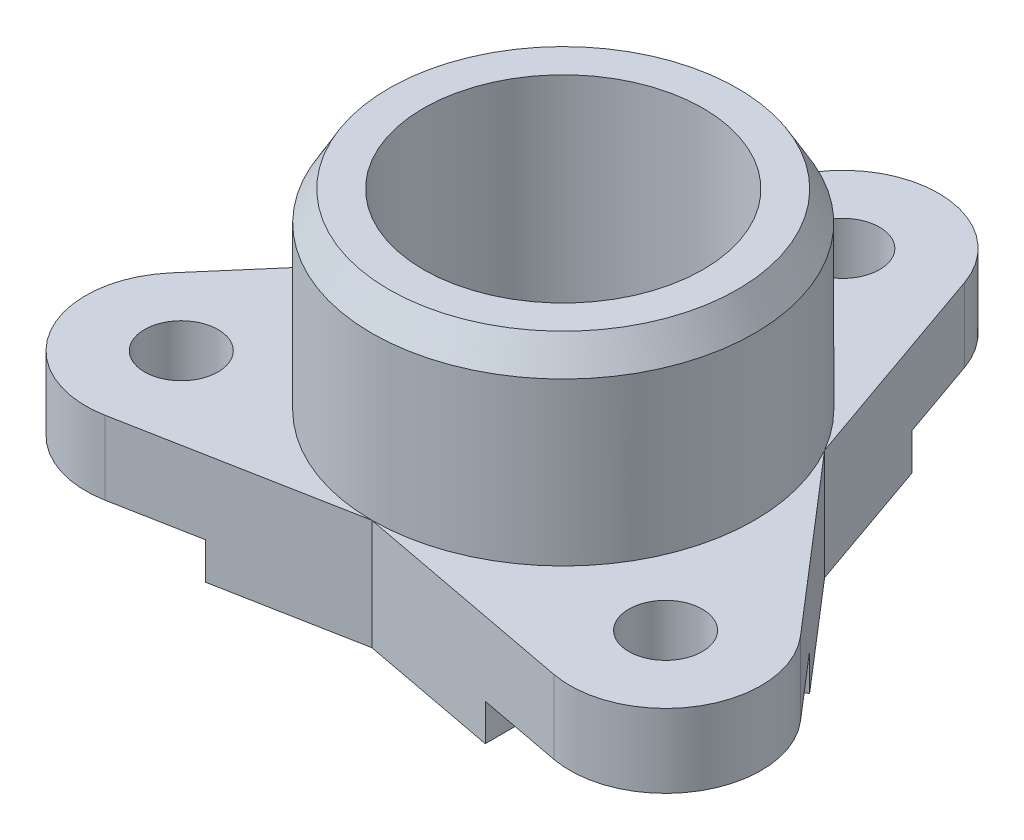
ISO-10303-21;
HEADER;
FILE_DESCRIPTION(('STEP AP214'),'2;1');
FILE_NAME('part.step','',(''),(''),'','','');
FILE_SCHEMA(('AUTOMOTIVE_DESIGN { 1 0 10303 214 1 1 1 1 }'));
ENDSEC;
DATA;
#1=APPLICATION_CONTEXT('core data for automotive mechanical design processes');
#2=APPLICATION_PROTOCOL_DEFINITION('international standard','automotive_design',2000,#1);
#3=PRODUCT_CONTEXT('',#1,'mechanical');
#4=PRODUCT('Part','Part','',(#3));
#5=PRODUCT_RELATED_PRODUCT_CATEGORY('part','',(#4));
#6=PRODUCT_DEFINITION_FORMATION('','',#4);
#7=PRODUCT_DEFINITION_CONTEXT('part definition',#1,'design');
#8=PRODUCT_DEFINITION('design','',#6,#7);
#9=PRODUCT_DEFINITION_SHAPE('','',#8);
#10=(LENGTH_UNIT() NAMED_UNIT(*) SI_UNIT(.MILLI.,.METRE.));
#11=(NAMED_UNIT(*) PLANE_ANGLE_UNIT() SI_UNIT($,.RADIAN.));
#12=(NAMED_UNIT(*) SI_UNIT($,.STERADIAN.) SOLID_ANGLE_UNIT());
#13=UNCERTAINTY_MEASURE_WITH_UNIT(LENGTH_MEASURE(1.E-05),#10,'distance_accuracy_value','');
#14=(GEOMETRIC_REPRESENTATION_CONTEXT(3) GLOBAL_UNCERTAINTY_ASSIGNED_CONTEXT((#13)) GLOBAL_UNIT_ASSIGNED_CONTEXT((#10,
#11,#12)) REPRESENTATION_CONTEXT('',''));
#15=CARTESIAN_POINT('',(0.,0.,0.));
#16=DIRECTION('',(0.,0.,1.));
#17=DIRECTION('',(1.,0.,0.));
#18=AXIS2_PLACEMENT_3D('',#15,#16,#17);
#19=CARTESIAN_POINT('',(0.,0.,0.));
#20=DIRECTION('',(0.,1.,0.));
#21=DIRECTION('',(0.,0.,1.));
#22=AXIS2_PLACEMENT_3D('',#19,#20,#21);
#23=PLANE('',#22);
#24=CARTESIAN_POINT('',(-8.22724133595217,0.,4.75));
#25=DIRECTION('',(0.,1.,0.));
#26=DIRECTION('',(0.,0.,1.));
#27=AXIS2_PLACEMENT_3D('',#24,#25,#26);
#28=CIRCLE('',#27,1.25);
#29=CARTESIAN_POINT('',(-8.22724133595217,0.,6.));
#30=VERTEX_POINT('',#29);
#31=EDGE_CURVE('E328',#30,#30,#28,.T.);
#32=ORIENTED_EDGE('',*,*,#31,.T.);
#33=EDGE_LOOP('',(#32));
#34=FACE_BOUND('',#33,.T.);
#35=CARTESIAN_POINT('',(0.,0.,-9.5));
#36=DIRECTION('',(0.,1.,0.));
#37=DIRECTION('',(0.,0.,1.));
#38=AXIS2_PLACEMENT_3D('',#35,#36,#37);
#39=CIRCLE('',#38,1.25);
#40=CARTESIAN_POINT('',(0.,0.,-8.25));
#41=VERTEX_POINT('',#40);
#42=EDGE_CURVE('E354',#41,#41,#39,.T.);
#43=ORIENTED_EDGE('',*,*,#42,.T.);
#44=EDGE_LOOP('',(#43));
#45=FACE_BOUND('',#44,.T.);
#46=CARTESIAN_POINT('',(0.,0.,0.));
#47=DIRECTION('',(0.,1.,0.));
#48=DIRECTION('',(0.,0.,1.));
#49=AXIS2_PLACEMENT_3D('',#46,#47,#48);
#50=CIRCLE('',#49,4.75);
#51=CARTESIAN_POINT('',(0.,0.,4.75));
#52=VERTEX_POINT('',#51);
#53=EDGE_CURVE('E299',#52,#52,#50,.T.);
#54=ORIENTED_EDGE('',*,*,#53,.T.);
#55=EDGE_LOOP('',(#54));
#56=FACE_BOUND('',#55,.T.);
#57=CARTESIAN_POINT('',(8.22724133595217,0.,4.75));
#58=DIRECTION('',(0.,1.,0.));
#59=DIRECTION('',(0.,0.,1.));
#60=AXIS2_PLACEMENT_3D('',#57,#58,#59);
#61=CIRCLE('',#60,1.25);
#62=CARTESIAN_POINT('',(8.22724133595217,0.,6.));
#63=VERTEX_POINT('',#62);
#64=EDGE_CURVE('E331',#63,#63,#61,.T.);
#65=ORIENTED_EDGE('',*,*,#64,.T.);
#66=EDGE_LOOP('',(#65));
#67=FACE_BOUND('',#66,.T.);
#68=DIRECTION('',(-0.499999999999992,0.,0.866025403784443));
#69=VECTOR('',#68,1.);
#70=CARTESIAN_POINT('',(-4.97964607176055,0.,-2.87499999999995));
#71=LINE('',#70,#69);
#72=CARTESIAN_POINT('',(-2.60464607176059,0.,-6.98862066797606));
#73=VERTEX_POINT('',#72);
#74=CARTESIAN_POINT('',(-7.35464607176051,0.,1.23862066797615));
#75=VERTEX_POINT('',#74);
#76=EDGE_CURVE('E210',#73,#75,#71,.T.);
#77=ORIENTED_EDGE('',*,*,#76,.F.);
#78=DIRECTION('',(-0.866025403784443,0.,-0.499999999999992));
#79=VECTOR('',#78,1.);
#80=CARTESIAN_POINT('',(2.37499999999996,0.,-4.1136206679761));
#81=LINE('',#80,#79);
#82=CARTESIAN_POINT('',(-4.03303634923954,0.,-7.81330217918636));
#83=VERTEX_POINT('',#82);
#84=EDGE_CURVE('E207',#73,#83,#81,.T.);
#85=ORIENTED_EDGE('',*,*,#84,.T.);
#86=DIRECTION('',(-0.330161167685148,0.,0.943924575033821));
#87=VECTOR('',#86,1.);
#88=CARTESIAN_POINT('',(-6.02840364790872,0.,-2.10858456312533));
#89=LINE('',#88,#87);
#90=CARTESIAN_POINT('',(-3.06775486885992,0.,-10.5730237949767));
#91=VERTEX_POINT('',#90);
#92=EDGE_CURVE('E345',#91,#83,#89,.T.);
#93=ORIENTED_EDGE('',*,*,#92,.F.);
#94=CARTESIAN_POINT('',(0.,0.,-9.5));
#95=DIRECTION('',(0.,1.,0.));
#96=DIRECTION('',(0.,0.,1.));
#97=AXIS2_PLACEMENT_3D('',#94,#95,#96);
#98=CIRCLE('',#97,3.25);
#99=CARTESIAN_POINT('',(3.06775486885992,0.,-10.5730237949767));
#100=VERTEX_POINT('',#99);
#101=EDGE_CURVE('E343',#100,#91,#98,.T.);
#102=ORIENTED_EDGE('',*,*,#101,.F.);
#103=DIRECTION('',(0.330161167685148,0.,0.943924575033821));
#104=VECTOR('',#103,1.);
#105=CARTESIAN_POINT('',(6.02840364790872,0.,-2.10858456312532));
#106=LINE('',#105,#104);
#107=CARTESIAN_POINT('',(4.03303634923946,0.,-7.81330217918642));
#108=VERTEX_POINT('',#107);
#109=EDGE_CURVE('E341',#100,#108,#106,.T.);
#110=ORIENTED_EDGE('',*,*,#109,.T.);
#111=DIRECTION('',(0.866025403784436,0.,-0.500000000000004));
#112=VECTOR('',#111,1.);
#113=CARTESIAN_POINT('',(-2.37500000000002,0.,-4.11362066797607));
#114=LINE('',#113,#112);
#115=CARTESIAN_POINT('',(2.60464607176049,0.,-6.9886206679761));
#116=VERTEX_POINT('',#115);
#117=EDGE_CURVE('E222',#116,#108,#114,.T.);
#118=ORIENTED_EDGE('',*,*,#117,.F.);
#119=DIRECTION('',(-0.500000000000004,0.,-0.866025403784436));
#120=VECTOR('',#119,1.);
#121=CARTESIAN_POINT('',(4.97964607176051,0.,-2.87500000000002));
#122=LINE('',#121,#120);
#123=CARTESIAN_POINT('',(7.35464607176053,0.,1.23862066797605));
#124=VERTEX_POINT('',#123);
#125=EDGE_CURVE('E60',#124,#116,#122,.T.);
#126=ORIENTED_EDGE('',*,*,#125,.F.);
#127=DIRECTION('',(0.866025403784436,0.,-0.500000000000004));
#128=VECTOR('',#127,1.);
#129=CARTESIAN_POINT('',(2.37500000000002,0.,4.11362066797607));
#130=LINE('',#129,#128);
#131=CARTESIAN_POINT('',(8.78303634923947,0.,0.413939156765781));
#132=VERTEX_POINT('',#131);
#133=EDGE_CURVE('E232',#124,#132,#130,.T.);
#134=ORIENTED_EDGE('',*,*,#133,.T.);
#135=DIRECTION('',(0.652382077393145,0.,0.757890246075383));
#136=VECTOR('',#135,1.);
#137=CARTESIAN_POINT('',(4.8402896216486,0.,-4.16645842179307));
#138=LINE('',#137,#136);
#139=CARTESIAN_POINT('',(10.6903846356972,0.,2.62975824847228));
#140=VERTEX_POINT('',#139);
#141=EDGE_CURVE('E339',#132,#140,#138,.T.);
#142=ORIENTED_EDGE('',*,*,#141,.T.);
#143=CARTESIAN_POINT('',(8.22724133595217,0.,4.75));
#144=DIRECTION('',(0.,1.,0.));
#145=DIRECTION('',(0.,0.,1.));
#146=AXIS2_PLACEMENT_3D('',#143,#144,#145);
#147=CIRCLE('',#146,3.25);
#148=CARTESIAN_POINT('',(7.62262976683724,0.,7.94326554650445));
#149=VERTEX_POINT('',#148);
#150=EDGE_CURVE('E336',#149,#140,#147,.T.);
#151=ORIENTED_EDGE('',*,*,#150,.F.);
#152=DIRECTION('',(0.982543245078293,0.,0.186034328958438));
#153=VECTOR('',#152,1.);
#154=CARTESIAN_POINT('',(-1.18811402626011,0.,6.27504298491839));
#155=LINE('',#154,#153);
#156=CARTESIAN_POINT('',(4.75,0.,7.39936302242063));
#157=VERTEX_POINT('',#156);
#158=EDGE_CURVE('E334',#157,#149,#155,.T.);
#159=ORIENTED_EDGE('',*,*,#158,.F.);
#160=DIRECTION('',(0.,0.,1.));
#161=VECTOR('',#160,1.);
#162=CARTESIAN_POINT('',(4.75,0.,0.));
#163=LINE('',#162,#161);
#164=CARTESIAN_POINT('',(4.75,0.,5.75));
#165=VERTEX_POINT('',#164);
#166=EDGE_CURVE('E250',#165,#157,#163,.T.);
#167=ORIENTED_EDGE('',*,*,#166,.F.);
#168=DIRECTION('',(1.,0.,0.));
#169=VECTOR('',#168,1.);
#170=CARTESIAN_POINT('',(0.,0.,5.75));
#171=LINE('',#170,#169);
#172=CARTESIAN_POINT('',(-4.75,0.,5.75));
#173=VERTEX_POINT('',#172);
#174=EDGE_CURVE('E275',#173,#165,#171,.T.);
#175=ORIENTED_EDGE('',*,*,#174,.F.);
#176=DIRECTION('',(0.,0.,1.));
#177=VECTOR('',#176,1.);
#178=CARTESIAN_POINT('',(-4.75,0.,0.));
#179=LINE('',#178,#177);
#180=CARTESIAN_POINT('',(-4.75,0.,7.39936302242063));
#181=VERTEX_POINT('',#180);
#182=EDGE_CURVE('E262',#173,#181,#179,.T.);
#183=ORIENTED_EDGE('',*,*,#182,.T.);
#184=DIRECTION('',(0.982543245078294,0.,-0.186034328958438));
#185=VECTOR('',#184,1.);
#186=CARTESIAN_POINT('',(1.18811402626011,0.,6.2750429849184));
#187=LINE('',#186,#185);
#188=CARTESIAN_POINT('',(-7.62262976683724,0.,7.94326554650445));
#189=VERTEX_POINT('',#188);
#190=EDGE_CURVE('E351',#189,#181,#187,.T.);
#191=ORIENTED_EDGE('',*,*,#190,.F.);
#192=CARTESIAN_POINT('',(-8.22724133595217,0.,4.75));
#193=DIRECTION('',(0.,1.,0.));
#194=DIRECTION('',(0.,0.,1.));
#195=AXIS2_PLACEMENT_3D('',#192,#193,#194);
#196=CIRCLE('',#195,3.25);
#197=CARTESIAN_POINT('',(-10.6903846356972,0.,2.62975824847228));
#198=VERTEX_POINT('',#197);
#199=EDGE_CURVE('E349',#198,#189,#196,.T.);
#200=ORIENTED_EDGE('',*,*,#199,.F.);
#201=DIRECTION('',(-0.652382077393145,0.,0.757890246075383));
#202=VECTOR('',#201,1.);
#203=CARTESIAN_POINT('',(-4.8402896216486,0.,-4.16645842179307));
#204=LINE('',#203,#202);
#205=CARTESIAN_POINT('',(-8.78303634923946,0.,0.413939156765772));
#206=VERTEX_POINT('',#205);
#207=EDGE_CURVE('E347',#206,#198,#204,.T.);
#208=ORIENTED_EDGE('',*,*,#207,.F.);
#209=DIRECTION('',(-0.866025403784443,0.,-0.499999999999992));
#210=VECTOR('',#209,1.);
#211=CARTESIAN_POINT('',(-2.37499999999996,0.,4.1136206679761));
#212=LINE('',#211,#210);
#213=EDGE_CURVE('E52',#75,#206,#212,.T.);
#214=ORIENTED_EDGE('',*,*,#213,.F.);
#215=EDGE_LOOP('',(#77,#85,#93,#102,#110,#118,#126,#134,#142,#151,#159,#167,#175,#183,#191,#200,
#208,#214));
#216=FACE_BOUND('',#215,.T.);
#217=ADVANCED_FACE('F36',(#34,#45,#56,#67,#216),#23,.F.);
#218=CARTESIAN_POINT('',(0.,2.5,0.));
#219=DIRECTION('',(0.,1.,0.));
#220=DIRECTION('',(0.,0.,1.));
#221=AXIS2_PLACEMENT_3D('',#218,#219,#220);
#222=PLANE('',#221);
#223=CARTESIAN_POINT('',(-8.22724133595217,2.5,4.75));
#224=DIRECTION('',(0.,1.,0.));
#225=DIRECTION('',(0.,0.,1.));
#226=AXIS2_PLACEMENT_3D('',#223,#224,#225);
#227=CIRCLE('',#226,1.25);
#228=CARTESIAN_POINT('',(-8.22724133595217,2.5,6.));
#229=VERTEX_POINT('',#228);
#230=EDGE_CURVE('E295',#229,#229,#227,.T.);
#231=ORIENTED_EDGE('',*,*,#230,.F.);
#232=EDGE_LOOP('',(#231));
#233=FACE_BOUND('',#232,.T.);
#234=DIRECTION('',(0.982543245078294,0.,-0.186034328958438));
#235=VECTOR('',#234,1.);
#236=CARTESIAN_POINT('',(1.18811402626011,2.5,6.2750429849184));
#237=LINE('',#236,#235);
#238=CARTESIAN_POINT('',(-7.62262976683724,2.5,7.94326554650445));
#239=VERTEX_POINT('',#238);
#240=CARTESIAN_POINT('',(0.,2.5,6.5));
#241=VERTEX_POINT('',#240);
#242=EDGE_CURVE('E321',#239,#241,#237,.T.);
#243=ORIENTED_EDGE('',*,*,#242,.T.);
#244=CARTESIAN_POINT('',(0.,2.5,0.));
#245=DIRECTION('',(0.,1.,0.));
#246=DIRECTION('',(0.,0.,1.));
#247=AXIS2_PLACEMENT_3D('',#244,#245,#246);
#248=CIRCLE('',#247,6.5);
#249=CARTESIAN_POINT('',(-5.62916512459885,2.5,-3.25000000000001));
#250=VERTEX_POINT('',#249);
#251=EDGE_CURVE('E294',#241,#250,#248,.F.);
#252=ORIENTED_EDGE('',*,*,#251,.T.);
#253=DIRECTION('',(-0.652382077393145,0.,0.757890246075383));
#254=VECTOR('',#253,1.);
#255=CARTESIAN_POINT('',(-4.8402896216486,2.5,-4.16645842179307));
#256=LINE('',#255,#254);
#257=CARTESIAN_POINT('',(-10.6903846356972,2.5,2.62975824847228));
#258=VERTEX_POINT('',#257);
#259=EDGE_CURVE('E188',#250,#258,#256,.T.);
#260=ORIENTED_EDGE('',*,*,#259,.T.);
#261=CARTESIAN_POINT('',(-8.22724133595217,2.5,4.75));
#262=DIRECTION('',(0.,1.,0.));
#263=DIRECTION('',(0.,0.,1.));
#264=AXIS2_PLACEMENT_3D('',#261,#262,#263);
#265=CIRCLE('',#264,3.25);
#266=EDGE_CURVE('E319',#258,#239,#265,.T.);
#267=ORIENTED_EDGE('',*,*,#266,.T.);
#268=EDGE_LOOP('',(#243,#252,#260,#267));
#269=FACE_BOUND('',#268,.T.);
#270=ADVANCED_FACE('F396',(#233,#269),#222,.T.);
#271=CARTESIAN_POINT('',(0.,2.5,-9.5));
#272=DIRECTION('',(0.,1.,0.));
#273=DIRECTION('',(0.,0.,1.));
#274=AXIS2_PLACEMENT_3D('',#271,#272,#273);
#275=CIRCLE('',#274,1.25);
#276=CARTESIAN_POINT('',(0.,2.5,-8.25));
#277=VERTEX_POINT('',#276);
#278=EDGE_CURVE('E324',#277,#277,#275,.T.);
#279=ORIENTED_EDGE('',*,*,#278,.F.);
#280=EDGE_LOOP('',(#279));
#281=FACE_BOUND('',#280,.T.);
#282=DIRECTION('',(-0.330161167685148,0.,0.943924575033821));
#283=VECTOR('',#282,1.);
#284=CARTESIAN_POINT('',(-6.02840364790872,2.5,-2.10858456312533));
#285=LINE('',#284,#283);
#286=CARTESIAN_POINT('',(-3.06775486885992,2.5,-10.5730237949767));
#287=VERTEX_POINT('',#286);
#288=EDGE_CURVE('E315',#287,#250,#285,.T.);
#289=ORIENTED_EDGE('',*,*,#288,.T.);
#290=CARTESIAN_POINT('',(5.62916512459885,2.5,-3.25000000000001));
#291=VERTEX_POINT('',#290);
#292=EDGE_CURVE('E293',#250,#291,#248,.F.);
#293=ORIENTED_EDGE('',*,*,#292,.T.);
#294=DIRECTION('',(0.330161167685148,0.,0.943924575033821));
#295=VECTOR('',#294,1.);
#296=CARTESIAN_POINT('',(6.02840364790872,2.5,-2.10858456312532));
#297=LINE('',#296,#295);
#298=CARTESIAN_POINT('',(3.06775486885992,2.5,-10.5730237949767));
#299=VERTEX_POINT('',#298);
#300=EDGE_CURVE('E310',#299,#291,#297,.T.);
#301=ORIENTED_EDGE('',*,*,#300,.F.);
#302=CARTESIAN_POINT('',(0.,2.5,-9.5));
#303=DIRECTION('',(0.,1.,0.));
#304=DIRECTION('',(0.,0.,1.));
#305=AXIS2_PLACEMENT_3D('',#302,#303,#304);
#306=CIRCLE('',#305,3.25);
#307=EDGE_CURVE('E313',#299,#287,#306,.T.);
#308=ORIENTED_EDGE('',*,*,#307,.T.);
#309=EDGE_LOOP('',(#289,#293,#301,#308));
#310=FACE_BOUND('',#309,.T.);
#311=ADVANCED_FACE('F402',(#281,#310),#222,.T.);
#312=CARTESIAN_POINT('',(-1.18811402626011,2.5,6.27504298491839));
#313=DIRECTION('',(0.186034328958438,0.,-0.982543245078294));
#314=DIRECTION('',(-0.982543245078294,0.,-0.186034328958438));
#315=AXIS2_PLACEMENT_3D('',#312,#313,#314);
#316=PLANE('',#315);
#317=DIRECTION('',(0.,-1.,0.));
#318=VECTOR('',#317,1.);
#319=CARTESIAN_POINT('',(0.,2.5,6.5));
#320=LINE('',#319,#318);
#321=CARTESIAN_POINT('',(0.,-1.25,6.5));
#322=VERTEX_POINT('',#321);
#323=EDGE_CURVE('E327',#241,#322,#320,.T.);
#324=ORIENTED_EDGE('',*,*,#323,.T.);
#325=DIRECTION('',(0.982543245078293,0.,0.186034328958438));
#326=VECTOR('',#325,1.);
#327=CARTESIAN_POINT('',(-1.18811402626011,-1.25,6.27504298491839));
#328=LINE('',#327,#326);
#329=CARTESIAN_POINT('',(4.75,-1.25,7.39936302242063));
#330=VERTEX_POINT('',#329);
#331=EDGE_CURVE('E261',#322,#330,#328,.T.);
#332=ORIENTED_EDGE('',*,*,#331,.T.);
#333=DIRECTION('',(0.,1.,0.));
#334=VECTOR('',#333,1.);
#335=CARTESIAN_POINT('',(4.75,-1.25,7.39936302242063));
#336=LINE('',#335,#334);
#337=EDGE_CURVE('E272',#330,#157,#336,.T.);
#338=ORIENTED_EDGE('',*,*,#337,.T.);
#339=ORIENTED_EDGE('',*,*,#158,.T.);
#340=DIRECTION('',(0.,-1.,0.));
#341=VECTOR('',#340,1.);
#342=CARTESIAN_POINT('',(7.62262976683724,2.5,7.94326554650445));
#343=LINE('',#342,#341);
#344=CARTESIAN_POINT('',(7.62262976683724,2.5,7.94326554650445));
#345=VERTEX_POINT('',#344);
#346=EDGE_CURVE('E374',#345,#149,#343,.T.);
#347=ORIENTED_EDGE('',*,*,#346,.F.);
#348=DIRECTION('',(0.982543245078293,0.,0.186034328958438));
#349=VECTOR('',#348,1.);
#350=CARTESIAN_POINT('',(-1.18811402626011,2.5,6.27504298491839));
#351=LINE('',#350,#349);
#352=EDGE_CURVE('E302',#241,#345,#351,.T.);
#353=ORIENTED_EDGE('',*,*,#352,.F.);
#354=EDGE_LOOP('',(#324,#332,#338,#339,#347,#353));
#355=FACE_BOUND('',#354,.T.);
#356=ADVANCED_FACE('F446',(#355),#316,.F.);
#357=CARTESIAN_POINT('',(8.22724133595217,2.5,4.75));
#358=DIRECTION('',(0.,-1.,0.));
#359=DIRECTION('',(0.,0.,-1.));
#360=AXIS2_PLACEMENT_3D('',#357,#358,#359);
#361=CYLINDRICAL_SURFACE('',#360,3.25);
#362=ORIENTED_EDGE('',*,*,#150,.T.);
#363=DIRECTION('',(0.,-1.,0.));
#364=VECTOR('',#363,1.);
#365=CARTESIAN_POINT('',(10.6903846356972,2.5,2.62975824847228));
#366=LINE('',#365,#364);
#367=CARTESIAN_POINT('',(10.6903846356972,2.5,2.62975824847228));
#368=VERTEX_POINT('',#367);
#369=EDGE_CURVE('E371',#368,#140,#366,.T.);
#370=ORIENTED_EDGE('',*,*,#369,.F.);
#371=CARTESIAN_POINT('',(8.22724133595217,2.5,4.75));
#372=DIRECTION('',(0.,1.,0.));
#373=DIRECTION('',(0.,0.,1.));
#374=AXIS2_PLACEMENT_3D('',#371,#372,#373);
#375=CIRCLE('',#374,3.25);
#376=EDGE_CURVE('E305',#345,#368,#375,.T.);
#377=ORIENTED_EDGE('',*,*,#376,.F.);
#378=ORIENTED_EDGE('',*,*,#346,.T.);
#379=EDGE_LOOP('',(#362,#370,#377,#378));
#380=FACE_BOUND('',#379,.T.);
#381=ADVANCED_FACE('F442',(#380),#361,.T.);
#382=CARTESIAN_POINT('',(4.8402896216486,2.5,-4.16645842179307));
#383=DIRECTION('',(0.757890246075383,0.,-0.652382077393145));
#384=DIRECTION('',(-0.652382077393145,0.,-0.757890246075383));
#385=AXIS2_PLACEMENT_3D('',#382,#383,#384);
#386=PLANE('',#385);
#387=ORIENTED_EDGE('',*,*,#141,.F.);
#388=DIRECTION('',(0.,1.,0.));
#389=VECTOR('',#388,1.);
#390=CARTESIAN_POINT('',(8.78303634923947,-1.25,0.413939156765729));
#391=LINE('',#390,#389);
#392=CARTESIAN_POINT('',(8.78303634923947,-1.25,0.413939156765729));
#393=VERTEX_POINT('',#392);
#394=EDGE_CURVE('E247',#393,#132,#391,.T.);
#395=ORIENTED_EDGE('',*,*,#394,.F.);
#396=DIRECTION('',(-0.652382077393149,0.,-0.75789024607538));
#397=VECTOR('',#396,1.);
#398=CARTESIAN_POINT('',(4.84028962164859,-1.25,-4.16645842179309));
#399=LINE('',#398,#397);
#400=CARTESIAN_POINT('',(5.62916512459884,-1.25,-3.25000000000003));
#401=VERTEX_POINT('',#400);
#402=EDGE_CURVE('E228',#393,#401,#399,.T.);
#403=ORIENTED_EDGE('',*,*,#402,.T.);
#404=DIRECTION('',(0.,-1.,0.));
#405=VECTOR('',#404,1.);
#406=CARTESIAN_POINT('',(5.62916512459885,2.5,-3.25));
#407=LINE('',#406,#405);
#408=EDGE_CURVE('E369',#291,#401,#407,.T.);
#409=ORIENTED_EDGE('',*,*,#408,.F.);
#410=DIRECTION('',(0.652382077393145,0.,0.757890246075383));
#411=VECTOR('',#410,1.);
#412=CARTESIAN_POINT('',(4.8402896216486,2.5,-4.16645842179307));
#413=LINE('',#412,#411);
#414=EDGE_CURVE('E307',#291,#368,#413,.T.);
#415=ORIENTED_EDGE('',*,*,#414,.T.);
#416=ORIENTED_EDGE('',*,*,#369,.T.);
#417=EDGE_LOOP('',(#387,#395,#403,#409,#415,#416));
#418=FACE_BOUND('',#417,.T.);
#419=ADVANCED_FACE('F438',(#418),#386,.T.);
#420=CARTESIAN_POINT('',(6.02840364790872,2.5,-2.10858456312532));
#421=DIRECTION('',(0.943924575033821,0.,-0.330161167685148));
#422=DIRECTION('',(-0.330161167685148,0.,-0.943924575033821));
#423=AXIS2_PLACEMENT_3D('',#420,#421,#422);
#424=PLANE('',#423);
#425=ORIENTED_EDGE('',*,*,#109,.F.);
#426=DIRECTION('',(0.,-1.,0.));
#427=VECTOR('',#426,1.);
#428=CARTESIAN_POINT('',(3.06775486885992,2.5,-10.5730237949767));
#429=LINE('',#428,#427);
#430=EDGE_CURVE('E367',#299,#100,#429,.T.);
#431=ORIENTED_EDGE('',*,*,#430,.F.);
#432=ORIENTED_EDGE('',*,*,#300,.T.);
#433=ORIENTED_EDGE('',*,*,#408,.T.);
#434=DIRECTION('',(-0.330161167685153,0.,-0.94392457503382));
#435=VECTOR('',#434,1.);
#436=CARTESIAN_POINT('',(6.02840364790871,-1.25,-2.10858456312535));
#437=LINE('',#436,#435);
#438=CARTESIAN_POINT('',(4.03303634923943,-1.25,-7.81330217918642));
#439=VERTEX_POINT('',#438);
#440=EDGE_CURVE('E231',#401,#439,#437,.T.);
#441=ORIENTED_EDGE('',*,*,#440,.T.);
#442=DIRECTION('',(0.,1.,0.));
#443=VECTOR('',#442,1.);
#444=CARTESIAN_POINT('',(4.03303634923943,-1.25,-7.81330217918642));
#445=LINE('',#444,#443);
#446=EDGE_CURVE('E242',#439,#108,#445,.T.);
#447=ORIENTED_EDGE('',*,*,#446,.T.);
#448=EDGE_LOOP('',(#425,#431,#432,#433,#441,#447));
#449=FACE_BOUND('',#448,.T.);
#450=ADVANCED_FACE('F434',(#449),#424,.T.);
#451=CARTESIAN_POINT('',(0.,2.5,-9.5));
#452=DIRECTION('',(0.,-1.,0.));
#453=DIRECTION('',(0.,0.,-1.));
#454=AXIS2_PLACEMENT_3D('',#451,#452,#453);
#455=CYLINDRICAL_SURFACE('',#454,3.25);
#456=ORIENTED_EDGE('',*,*,#101,.T.);
#457=DIRECTION('',(0.,-1.,0.));
#458=VECTOR('',#457,1.);
#459=CARTESIAN_POINT('',(-3.06775486885992,2.5,-10.5730237949767));
#460=LINE('',#459,#458);
#461=EDGE_CURVE('E192',#287,#91,#460,.T.);
#462=ORIENTED_EDGE('',*,*,#461,.F.);
#463=ORIENTED_EDGE('',*,*,#307,.F.);
#464=ORIENTED_EDGE('',*,*,#430,.T.);
#465=EDGE_LOOP('',(#456,#462,#463,#464));
#466=FACE_BOUND('',#465,.T.);
#467=ADVANCED_FACE('F431',(#466),#455,.T.);
#468=CARTESIAN_POINT('',(-6.02840364790872,2.5,-2.10858456312533));
#469=DIRECTION('',(0.943924575033821,0.,0.330161167685148));
#470=DIRECTION('',(0.330161167685148,0.,-0.943924575033821));
#471=AXIS2_PLACEMENT_3D('',#468,#469,#470);
#472=PLANE('',#471);
#473=ORIENTED_EDGE('',*,*,#92,.T.);
#474=DIRECTION('',(0.,1.,0.));
#475=VECTOR('',#474,1.);
#476=CARTESIAN_POINT('',(-4.03303634923954,-1.25,-7.81330217918636));
#477=LINE('',#476,#475);
#478=CARTESIAN_POINT('',(-4.03303634923954,-1.25,-7.81330217918636));
#479=VERTEX_POINT('',#478);
#480=EDGE_CURVE('E206',#479,#83,#477,.T.);
#481=ORIENTED_EDGE('',*,*,#480,.F.);
#482=DIRECTION('',(-0.33016116768514,0.,0.943924575033824));
#483=VECTOR('',#482,1.);
#484=CARTESIAN_POINT('',(-6.02840364790874,-1.25,-2.10858456312527));
#485=LINE('',#484,#483);
#486=CARTESIAN_POINT('',(-5.62916512459888,-1.25,-3.24999999999995));
#487=VERTEX_POINT('',#486);
#488=EDGE_CURVE('E199',#479,#487,#485,.T.);
#489=ORIENTED_EDGE('',*,*,#488,.T.);
#490=DIRECTION('',(0.,-1.,0.));
#491=VECTOR('',#490,1.);
#492=CARTESIAN_POINT('',(-5.62916512459885,2.5,-3.25));
#493=LINE('',#492,#491);
#494=EDGE_CURVE('E183',#250,#487,#493,.T.);
#495=ORIENTED_EDGE('',*,*,#494,.F.);
#496=ORIENTED_EDGE('',*,*,#288,.F.);
#497=ORIENTED_EDGE('',*,*,#461,.T.);
#498=EDGE_LOOP('',(#473,#481,#489,#495,#496,#497));
#499=FACE_BOUND('',#498,.T.);
#500=ADVANCED_FACE('F205',(#499),#472,.F.);
#501=CARTESIAN_POINT('',(-4.8402896216486,2.5,-4.16645842179307));
#502=DIRECTION('',(0.757890246075383,0.,0.652382077393145));
#503=DIRECTION('',(0.652382077393145,0.,-0.757890246075383));
#504=AXIS2_PLACEMENT_3D('',#501,#502,#503);
#505=PLANE('',#504);
#506=ORIENTED_EDGE('',*,*,#494,.T.);
#507=DIRECTION('',(-0.652382077393138,0.,0.757890246075389));
#508=VECTOR('',#507,1.);
#509=CARTESIAN_POINT('',(-4.84028962164864,-1.25,-4.16645842179302));
#510=LINE('',#509,#508);
#511=CARTESIAN_POINT('',(-8.78303634923946,-1.25,0.413939156765853));
#512=VERTEX_POINT('',#511);
#513=EDGE_CURVE('E186',#487,#512,#510,.T.);
#514=ORIENTED_EDGE('',*,*,#513,.T.);
#515=DIRECTION('',(0.,1.,0.));
#516=VECTOR('',#515,1.);
#517=CARTESIAN_POINT('',(-8.78303634923946,-1.25,0.413939156765853));
#518=LINE('',#517,#516);
#519=EDGE_CURVE('E218',#512,#206,#518,.T.);
#520=ORIENTED_EDGE('',*,*,#519,.T.);
#521=ORIENTED_EDGE('',*,*,#207,.T.);
#522=DIRECTION('',(0.,-1.,0.));
#523=VECTOR('',#522,1.);
#524=CARTESIAN_POINT('',(-10.6903846356972,2.5,2.62975824847228));
#525=LINE('',#524,#523);
#526=EDGE_CURVE('E193',#258,#198,#525,.T.);
#527=ORIENTED_EDGE('',*,*,#526,.F.);
#528=ORIENTED_EDGE('',*,*,#259,.F.);
#529=EDGE_LOOP('',(#506,#514,#520,#521,#527,#528));
#530=FACE_BOUND('',#529,.T.);
#531=ADVANCED_FACE('F185',(#530),#505,.F.);
#532=CARTESIAN_POINT('',(-8.22724133595217,2.5,4.75));
#533=DIRECTION('',(0.,-1.,0.));
#534=DIRECTION('',(0.,0.,-1.));
#535=AXIS2_PLACEMENT_3D('',#532,#533,#534);
#536=CYLINDRICAL_SURFACE('',#535,3.25);
#537=ORIENTED_EDGE('',*,*,#199,.T.);
#538=DIRECTION('',(0.,-1.,0.));
#539=VECTOR('',#538,1.);
#540=CARTESIAN_POINT('',(-7.62262976683724,2.5,7.94326554650445));
#541=LINE('',#540,#539);
#542=EDGE_CURVE('E360',#239,#189,#541,.T.);
#543=ORIENTED_EDGE('',*,*,#542,.F.);
#544=ORIENTED_EDGE('',*,*,#266,.F.);
#545=ORIENTED_EDGE('',*,*,#526,.T.);
#546=EDGE_LOOP('',(#537,#543,#544,#545));
#547=FACE_BOUND('',#546,.T.);
#548=ADVANCED_FACE('F418',(#547),#536,.T.);
#549=CARTESIAN_POINT('',(0.,2.5,-9.5));
#550=DIRECTION('',(0.,-1.,0.));
#551=DIRECTION('',(0.,0.,-1.));
#552=AXIS2_PLACEMENT_3D('',#549,#550,#551);
#553=CYLINDRICAL_SURFACE('',#552,1.25);
#554=ORIENTED_EDGE('',*,*,#278,.T.);
#555=EDGE_LOOP('',(#554));
#556=FACE_BOUND('',#555,.T.);
#557=ORIENTED_EDGE('',*,*,#42,.F.);
#558=EDGE_LOOP('',(#557));
#559=FACE_BOUND('',#558,.T.);
#560=ADVANCED_FACE('F414',(#556,#559),#553,.F.);
#561=CARTESIAN_POINT('',(1.18811402626011,2.5,6.2750429849184));
#562=DIRECTION('',(-0.186034328958438,0.,-0.982543245078294));
#563=DIRECTION('',(-0.982543245078294,0.,0.186034328958438));
#564=AXIS2_PLACEMENT_3D('',#561,#562,#563);
#565=PLANE('',#564);
#566=ORIENTED_EDGE('',*,*,#190,.T.);
#567=DIRECTION('',(0.,1.,0.));
#568=VECTOR('',#567,1.);
#569=CARTESIAN_POINT('',(-4.75,-1.25,7.39936302242063));
#570=LINE('',#569,#568);
#571=CARTESIAN_POINT('',(-4.75,-1.25,7.39936302242063));
#572=VERTEX_POINT('',#571);
#573=EDGE_CURVE('E279',#572,#181,#570,.T.);
#574=ORIENTED_EDGE('',*,*,#573,.F.);
#575=DIRECTION('',(0.982543245078294,0.,-0.186034328958438));
#576=VECTOR('',#575,1.);
#577=CARTESIAN_POINT('',(1.18811402626011,-1.25,6.2750429849184));
#578=LINE('',#577,#576);
#579=EDGE_CURVE('E258',#572,#322,#578,.T.);
#580=ORIENTED_EDGE('',*,*,#579,.T.);
#581=ORIENTED_EDGE('',*,*,#323,.F.);
#582=ORIENTED_EDGE('',*,*,#242,.F.);
#583=ORIENTED_EDGE('',*,*,#542,.T.);
#584=EDGE_LOOP('',(#566,#574,#580,#581,#582,#583));
#585=FACE_BOUND('',#584,.T.);
#586=ADVANCED_FACE('F417',(#585),#565,.F.);
#587=CARTESIAN_POINT('',(8.22724133595217,2.5,4.75));
#588=DIRECTION('',(0.,-1.,0.));
#589=DIRECTION('',(0.,0.,-1.));
#590=AXIS2_PLACEMENT_3D('',#587,#588,#589);
#591=CYLINDRICAL_SURFACE('',#590,1.25);
#592=CARTESIAN_POINT('',(8.22724133595217,2.5,4.75));
#593=DIRECTION('',(0.,1.,0.));
#594=DIRECTION('',(0.,0.,1.));
#595=AXIS2_PLACEMENT_3D('',#592,#593,#594);
#596=CIRCLE('',#595,1.25);
#597=CARTESIAN_POINT('',(8.22724133595217,2.5,6.));
#598=VERTEX_POINT('',#597);
#599=EDGE_CURVE('E298',#598,#598,#596,.T.);
#600=ORIENTED_EDGE('',*,*,#599,.T.);
#601=EDGE_LOOP('',(#600));
#602=FACE_BOUND('',#601,.T.);
#603=ORIENTED_EDGE('',*,*,#64,.F.);
#604=EDGE_LOOP('',(#603));
#605=FACE_BOUND('',#604,.T.);
#606=ADVANCED_FACE('F422',(#602,#605),#591,.F.);
#607=CARTESIAN_POINT('',(-8.22724133595217,2.5,4.75));
#608=DIRECTION('',(0.,-1.,0.));
#609=DIRECTION('',(0.,0.,-1.));
#610=AXIS2_PLACEMENT_3D('',#607,#608,#609);
#611=CYLINDRICAL_SURFACE('',#610,1.25);
#612=ORIENTED_EDGE('',*,*,#230,.T.);
#613=EDGE_LOOP('',(#612));
#614=FACE_BOUND('',#613,.T.);
#615=ORIENTED_EDGE('',*,*,#31,.F.);
#616=EDGE_LOOP('',(#615));
#617=FACE_BOUND('',#616,.T.);
#618=ADVANCED_FACE('F412',(#614,#617),#611,.F.);
#619=CARTESIAN_POINT('',(0.,2.5,0.));
#620=DIRECTION('',(0.,-1.,0.));
#621=DIRECTION('',(0.,0.,-1.));
#622=AXIS2_PLACEMENT_3D('',#619,#620,#621);
#623=CYLINDRICAL_SURFACE('',#622,4.75);
#624=ORIENTED_EDGE('',*,*,#53,.F.);
#625=EDGE_LOOP('',(#624));
#626=FACE_BOUND('',#625,.T.);
#627=CARTESIAN_POINT('',(0.,9.,0.));
#628=DIRECTION('',(0.,1.,0.));
#629=DIRECTION('',(0.,0.,1.));
#630=AXIS2_PLACEMENT_3D('',#627,#628,#629);
#631=CIRCLE('',#630,4.75);
#632=CARTESIAN_POINT('',(0.,9.,4.75));
#633=VERTEX_POINT('',#632);
#634=EDGE_CURVE('E281',#633,#633,#631,.T.);
#635=ORIENTED_EDGE('',*,*,#634,.T.);
#636=EDGE_LOOP('',(#635));
#637=FACE_BOUND('',#636,.T.);
#638=ADVANCED_FACE('F409',(#626,#637),#623,.F.);
#639=ORIENTED_EDGE('',*,*,#599,.F.);
#640=EDGE_LOOP('',(#639));
#641=FACE_BOUND('',#640,.T.);
#642=ORIENTED_EDGE('',*,*,#414,.F.);
#643=EDGE_CURVE('E290',#291,#241,#248,.F.);
#644=ORIENTED_EDGE('',*,*,#643,.T.);
#645=ORIENTED_EDGE('',*,*,#352,.T.);
#646=ORIENTED_EDGE('',*,*,#376,.T.);
#647=EDGE_LOOP('',(#642,#644,#645,#646));
#648=FACE_BOUND('',#647,.T.);
#649=ADVANCED_FACE('F405',(#641,#648),#222,.T.);
#650=CARTESIAN_POINT('',(0.,9.,0.));
#651=DIRECTION('',(0.,-1.,0.));
#652=DIRECTION('',(0.,0.,-1.));
#653=AXIS2_PLACEMENT_3D('',#650,#651,#652);
#654=CYLINDRICAL_SURFACE('',#653,6.5);
#655=CARTESIAN_POINT('',(0.,7.99999999999999,0.));
#656=DIRECTION('',(0.,1.,0.));
#657=DIRECTION('',(0.,0.,1.));
#658=AXIS2_PLACEMENT_3D('',#655,#656,#657);
#659=CIRCLE('',#658,6.5);
#660=CARTESIAN_POINT('',(0.,7.99999999999999,6.5));
#661=VERTEX_POINT('',#660);
#662=EDGE_CURVE('E11',#661,#661,#659,.F.);
#663=ORIENTED_EDGE('',*,*,#662,.T.);
#664=EDGE_LOOP('',(#663));
#665=FACE_BOUND('',#664,.T.);
#666=ORIENTED_EDGE('',*,*,#251,.F.);
#667=ORIENTED_EDGE('',*,*,#643,.F.);
#668=ORIENTED_EDGE('',*,*,#292,.F.);
#669=EDGE_LOOP('',(#666,#667,#668));
#670=FACE_BOUND('',#669,.T.);
#671=ADVANCED_FACE('F392',(#665,#670),#654,.T.);
#672=CARTESIAN_POINT('',(0.,9.,0.));
#673=DIRECTION('',(0.,1.,0.));
#674=DIRECTION('',(0.,0.,1.));
#675=AXIS2_PLACEMENT_3D('',#672,#673,#674);
#676=PLANE('',#675);
#677=CARTESIAN_POINT('',(0.,9.,0.));
#678=DIRECTION('',(0.,1.,0.));
#679=DIRECTION('',(0.,0.,1.));
#680=AXIS2_PLACEMENT_3D('',#677,#678,#679);
#681=CIRCLE('',#680,5.92264973081037);
#682=CARTESIAN_POINT('',(0.,9.,5.92264973081037));
#683=VERTEX_POINT('',#682);
#684=EDGE_CURVE('E45',#683,#683,#681,.T.);
#685=ORIENTED_EDGE('',*,*,#684,.T.);
#686=EDGE_LOOP('',(#685));
#687=FACE_BOUND('',#686,.T.);
#688=ORIENTED_EDGE('',*,*,#634,.F.);
#689=EDGE_LOOP('',(#688));
#690=FACE_BOUND('',#689,.T.);
#691=ADVANCED_FACE('F379',(#687,#690),#676,.T.);
#692=CARTESIAN_POINT('',(0.,9.,0.));
#693=DIRECTION('',(0.,-1.,0.));
#694=DIRECTION('',(0.,0.,-1.));
#695=AXIS2_PLACEMENT_3D('',#692,#693,#694);
#696=CONICAL_SURFACE('',#695,5.92264973081037,0.523598775598296);
#697=ORIENTED_EDGE('',*,*,#662,.F.);
#698=EDGE_LOOP('',(#697));
#699=FACE_BOUND('',#698,.T.);
#700=ORIENTED_EDGE('',*,*,#684,.F.);
#701=EDGE_LOOP('',(#700));
#702=FACE_BOUND('',#701,.T.);
#703=ADVANCED_FACE('F39',(#699,#702),#696,.T.);
#704=CARTESIAN_POINT('',(-4.75,-1.25,0.));
#705=DIRECTION('',(-1.,0.,0.));
#706=DIRECTION('',(0.,0.,1.));
#707=AXIS2_PLACEMENT_3D('',#704,#705,#706);
#708=PLANE('',#707);
#709=ORIENTED_EDGE('',*,*,#182,.F.);
#710=DIRECTION('',(0.,1.,0.));
#711=VECTOR('',#710,1.);
#712=CARTESIAN_POINT('',(-4.75,-1.25,5.75));
#713=LINE('',#712,#711);
#714=CARTESIAN_POINT('',(-4.75,-1.25,5.75));
#715=VERTEX_POINT('',#714);
#716=EDGE_CURVE('E282',#715,#173,#713,.T.);
#717=ORIENTED_EDGE('',*,*,#716,.F.);
#718=DIRECTION('',(0.,0.,1.));
#719=VECTOR('',#718,1.);
#720=CARTESIAN_POINT('',(-4.75,-1.25,0.));
#721=LINE('',#720,#719);
#722=EDGE_CURVE('E269',#715,#572,#721,.T.);
#723=ORIENTED_EDGE('',*,*,#722,.T.);
#724=ORIENTED_EDGE('',*,*,#573,.T.);
#725=EDGE_LOOP('',(#709,#717,#723,#724));
#726=FACE_BOUND('',#725,.T.);
#727=ADVANCED_FACE('F383',(#726),#708,.T.);
#728=CARTESIAN_POINT('',(0.,-1.25,5.75));
#729=DIRECTION('',(0.,0.,1.));
#730=DIRECTION('',(1.,0.,0.));
#731=AXIS2_PLACEMENT_3D('',#728,#729,#730);
#732=PLANE('',#731);
#733=ORIENTED_EDGE('',*,*,#174,.T.);
#734=DIRECTION('',(0.,1.,0.));
#735=VECTOR('',#734,1.);
#736=CARTESIAN_POINT('',(4.75,-1.25,5.75));
#737=LINE('',#736,#735);
#738=CARTESIAN_POINT('',(4.75,-1.25,5.75));
#739=VERTEX_POINT('',#738);
#740=EDGE_CURVE('E284',#739,#165,#737,.T.);
#741=ORIENTED_EDGE('',*,*,#740,.F.);
#742=DIRECTION('',(1.,0.,0.));
#743=VECTOR('',#742,1.);
#744=CARTESIAN_POINT('',(0.,-1.25,5.75));
#745=LINE('',#744,#743);
#746=EDGE_CURVE('E267',#715,#739,#745,.T.);
#747=ORIENTED_EDGE('',*,*,#746,.F.);
#748=ORIENTED_EDGE('',*,*,#716,.T.);
#749=EDGE_LOOP('',(#733,#741,#747,#748));
#750=FACE_BOUND('',#749,.T.);
#751=ADVANCED_FACE('F389',(#750),#732,.F.);
#752=CARTESIAN_POINT('',(4.75,-1.25,0.));
#753=DIRECTION('',(-1.,0.,0.));
#754=DIRECTION('',(0.,0.,1.));
#755=AXIS2_PLACEMENT_3D('',#752,#753,#754);
#756=PLANE('',#755);
#757=ORIENTED_EDGE('',*,*,#166,.T.);
#758=ORIENTED_EDGE('',*,*,#337,.F.);
#759=DIRECTION('',(0.,0.,1.));
#760=VECTOR('',#759,1.);
#761=CARTESIAN_POINT('',(4.75,-1.25,0.));
#762=LINE('',#761,#760);
#763=EDGE_CURVE('E265',#739,#330,#762,.T.);
#764=ORIENTED_EDGE('',*,*,#763,.F.);
#765=ORIENTED_EDGE('',*,*,#740,.T.);
#766=EDGE_LOOP('',(#757,#758,#764,#765));
#767=FACE_BOUND('',#766,.T.);
#768=ADVANCED_FACE('F518',(#767),#756,.F.);
#769=CARTESIAN_POINT('',(0.,-1.25,0.));
#770=DIRECTION('',(0.,1.,0.));
#771=DIRECTION('',(0.,0.,1.));
#772=AXIS2_PLACEMENT_3D('',#769,#770,#771);
#773=PLANE('',#772);
#774=ORIENTED_EDGE('',*,*,#579,.F.);
#775=ORIENTED_EDGE('',*,*,#722,.F.);
#776=ORIENTED_EDGE('',*,*,#746,.T.);
#777=ORIENTED_EDGE('',*,*,#763,.T.);
#778=ORIENTED_EDGE('',*,*,#331,.F.);
#779=EDGE_LOOP('',(#774,#775,#776,#777,#778));
#780=FACE_BOUND('',#779,.T.);
#781=ADVANCED_FACE('F510',(#780),#773,.F.);
#782=CARTESIAN_POINT('',(2.37500000000002,-1.25,4.11362066797607));
#783=DIRECTION('',(0.500000000000004,0.,0.866025403784436));
#784=DIRECTION('',(0.866025403784436,0.,-0.500000000000004));
#785=AXIS2_PLACEMENT_3D('',#782,#783,#784);
#786=PLANE('',#785);
#787=ORIENTED_EDGE('',*,*,#133,.F.);
#788=DIRECTION('',(0.,1.,0.));
#789=VECTOR('',#788,1.);
#790=CARTESIAN_POINT('',(7.35464607176053,-1.25,1.23862066797605));
#791=LINE('',#790,#789);
#792=CARTESIAN_POINT('',(7.35464607176053,-1.25,1.23862066797605));
#793=VERTEX_POINT('',#792);
#794=EDGE_CURVE('E251',#793,#124,#791,.T.);
#795=ORIENTED_EDGE('',*,*,#794,.F.);
#796=DIRECTION('',(0.866025403784436,0.,-0.500000000000004));
#797=VECTOR('',#796,1.);
#798=CARTESIAN_POINT('',(2.37500000000002,-1.25,4.11362066797607));
#799=LINE('',#798,#797);
#800=EDGE_CURVE('E239',#793,#393,#799,.T.);
#801=ORIENTED_EDGE('',*,*,#800,.T.);
#802=ORIENTED_EDGE('',*,*,#394,.T.);
#803=EDGE_LOOP('',(#787,#795,#801,#802));
#804=FACE_BOUND('',#803,.T.);
#805=ADVANCED_FACE('F524',(#804),#786,.T.);
#806=CARTESIAN_POINT('',(4.97964607176051,-1.25,-2.87500000000002));
#807=DIRECTION('',(0.866025403784436,0.,-0.500000000000004));
#808=DIRECTION('',(-0.500000000000004,0.,-0.866025403784436));
#809=AXIS2_PLACEMENT_3D('',#806,#807,#808);
#810=PLANE('',#809);
#811=ORIENTED_EDGE('',*,*,#125,.T.);
#812=DIRECTION('',(0.,1.,0.));
#813=VECTOR('',#812,1.);
#814=CARTESIAN_POINT('',(2.60464607176049,-1.25,-6.9886206679761));
#815=LINE('',#814,#813);
#816=CARTESIAN_POINT('',(2.60464607176049,-1.25,-6.9886206679761));
#817=VERTEX_POINT('',#816);
#818=EDGE_CURVE('E253',#817,#116,#815,.T.);
#819=ORIENTED_EDGE('',*,*,#818,.F.);
#820=DIRECTION('',(-0.500000000000004,0.,-0.866025403784436));
#821=VECTOR('',#820,1.);
#822=CARTESIAN_POINT('',(4.97964607176051,-1.25,-2.87500000000002));
#823=LINE('',#822,#821);
#824=EDGE_CURVE('E237',#793,#817,#823,.T.);
#825=ORIENTED_EDGE('',*,*,#824,.F.);
#826=ORIENTED_EDGE('',*,*,#794,.T.);
#827=EDGE_LOOP('',(#811,#819,#825,#826));
#828=FACE_BOUND('',#827,.T.);
#829=ADVANCED_FACE('F526',(#828),#810,.F.);
#830=CARTESIAN_POINT('',(-2.37500000000002,-1.25,-4.11362066797607));
#831=DIRECTION('',(0.500000000000004,0.,0.866025403784436));
#832=DIRECTION('',(0.866025403784436,0.,-0.500000000000004));
#833=AXIS2_PLACEMENT_3D('',#830,#831,#832);
#834=PLANE('',#833);
#835=ORIENTED_EDGE('',*,*,#117,.T.);
#836=ORIENTED_EDGE('',*,*,#446,.F.);
#837=DIRECTION('',(0.866025403784436,0.,-0.500000000000004));
#838=VECTOR('',#837,1.);
#839=CARTESIAN_POINT('',(-2.37500000000002,-1.25,-4.11362066797607));
#840=LINE('',#839,#838);
#841=EDGE_CURVE('E235',#817,#439,#840,.T.);
#842=ORIENTED_EDGE('',*,*,#841,.F.);
#843=ORIENTED_EDGE('',*,*,#818,.T.);
#844=EDGE_LOOP('',(#835,#836,#842,#843));
#845=FACE_BOUND('',#844,.T.);
#846=ADVANCED_FACE('F490',(#845),#834,.F.);
#847=CARTESIAN_POINT('',(0.,-1.25,0.));
#848=DIRECTION('',(0.,1.,0.));
#849=DIRECTION('',(0.866025403784436,0.,-0.500000000000004));
#850=AXIS2_PLACEMENT_3D('',#847,#848,#849);
#851=PLANE('',#850);
#852=ORIENTED_EDGE('',*,*,#402,.F.);
#853=ORIENTED_EDGE('',*,*,#800,.F.);
#854=ORIENTED_EDGE('',*,*,#824,.T.);
#855=ORIENTED_EDGE('',*,*,#841,.T.);
#856=ORIENTED_EDGE('',*,*,#440,.F.);
#857=EDGE_LOOP('',(#852,#853,#854,#855,#856));
#858=FACE_BOUND('',#857,.T.);
#859=ADVANCED_FACE('F483',(#858),#851,.F.);
#860=CARTESIAN_POINT('',(2.37499999999996,-1.25,-4.1136206679761));
#861=DIRECTION('',(0.499999999999992,0.,-0.866025403784443));
#862=DIRECTION('',(-0.866025403784443,0.,-0.499999999999992));
#863=AXIS2_PLACEMENT_3D('',#860,#861,#862);
#864=PLANE('',#863);
#865=ORIENTED_EDGE('',*,*,#84,.F.);
#866=DIRECTION('',(0.,1.,0.));
#867=VECTOR('',#866,1.);
#868=CARTESIAN_POINT('',(-2.60464607176059,-1.25,-6.98862066797606));
#869=LINE('',#868,#867);
#870=CARTESIAN_POINT('',(-2.60464607176059,-1.25,-6.98862066797606));
#871=VERTEX_POINT('',#870);
#872=EDGE_CURVE('E223',#871,#73,#869,.T.);
#873=ORIENTED_EDGE('',*,*,#872,.F.);
#874=DIRECTION('',(-0.866025403784443,0.,-0.499999999999992));
#875=VECTOR('',#874,1.);
#876=CARTESIAN_POINT('',(2.37499999999996,-1.25,-4.1136206679761));
#877=LINE('',#876,#875);
#878=EDGE_CURVE('E216',#871,#479,#877,.T.);
#879=ORIENTED_EDGE('',*,*,#878,.T.);
#880=ORIENTED_EDGE('',*,*,#480,.T.);
#881=EDGE_LOOP('',(#865,#873,#879,#880));
#882=FACE_BOUND('',#881,.T.);
#883=ADVANCED_FACE('F498',(#882),#864,.T.);
#884=CARTESIAN_POINT('',(-4.97964607176055,-1.25,-2.87499999999995));
#885=DIRECTION('',(-0.866025403784443,0.,-0.499999999999992));
#886=DIRECTION('',(-0.499999999999992,0.,0.866025403784443));
#887=AXIS2_PLACEMENT_3D('',#884,#885,#886);
#888=PLANE('',#887);
#889=ORIENTED_EDGE('',*,*,#76,.T.);
#890=DIRECTION('',(0.,1.,0.));
#891=VECTOR('',#890,1.);
#892=CARTESIAN_POINT('',(-7.35464607176051,-1.25,1.23862066797615));
#893=LINE('',#892,#891);
#894=CARTESIAN_POINT('',(-7.35464607176051,-1.25,1.23862066797615));
#895=VERTEX_POINT('',#894);
#896=EDGE_CURVE('E225',#895,#75,#893,.T.);
#897=ORIENTED_EDGE('',*,*,#896,.F.);
#898=DIRECTION('',(-0.499999999999992,0.,0.866025403784443));
#899=VECTOR('',#898,1.);
#900=CARTESIAN_POINT('',(-4.97964607176055,-1.25,-2.87499999999995));
#901=LINE('',#900,#899);
#902=EDGE_CURVE('E214',#871,#895,#901,.T.);
#903=ORIENTED_EDGE('',*,*,#902,.F.);
#904=ORIENTED_EDGE('',*,*,#872,.T.);
#905=EDGE_LOOP('',(#889,#897,#903,#904));
#906=FACE_BOUND('',#905,.T.);
#907=ADVANCED_FACE('F502',(#906),#888,.F.);
#908=CARTESIAN_POINT('',(-2.37499999999996,-1.25,4.1136206679761));
#909=DIRECTION('',(0.499999999999992,0.,-0.866025403784443));
#910=DIRECTION('',(-0.866025403784443,0.,-0.499999999999992));
#911=AXIS2_PLACEMENT_3D('',#908,#909,#910);
#912=PLANE('',#911);
#913=ORIENTED_EDGE('',*,*,#213,.T.);
#914=ORIENTED_EDGE('',*,*,#519,.F.);
#915=DIRECTION('',(-0.866025403784443,0.,-0.499999999999992));
#916=VECTOR('',#915,1.);
#917=CARTESIAN_POINT('',(-2.37499999999996,-1.25,4.1136206679761));
#918=LINE('',#917,#916);
#919=EDGE_CURVE('E202',#895,#512,#918,.T.);
#920=ORIENTED_EDGE('',*,*,#919,.F.);
#921=ORIENTED_EDGE('',*,*,#896,.T.);
#922=EDGE_LOOP('',(#913,#914,#920,#921));
#923=FACE_BOUND('',#922,.T.);
#924=ADVANCED_FACE('F503',(#923),#912,.F.);
#925=CARTESIAN_POINT('',(0.,-1.25,0.));
#926=DIRECTION('',(0.,1.,0.));
#927=DIRECTION('',(-0.866025403784443,0.,-0.499999999999992));
#928=AXIS2_PLACEMENT_3D('',#925,#926,#927);
#929=PLANE('',#928);
#930=ORIENTED_EDGE('',*,*,#488,.F.);
#931=ORIENTED_EDGE('',*,*,#878,.F.);
#932=ORIENTED_EDGE('',*,*,#902,.T.);
#933=ORIENTED_EDGE('',*,*,#919,.T.);
#934=ORIENTED_EDGE('',*,*,#513,.F.);
#935=EDGE_LOOP('',(#930,#931,#932,#933,#934));
#936=FACE_BOUND('',#935,.T.);
#937=ADVANCED_FACE('F197',(#936),#929,.F.);
#938=CLOSED_SHELL('',(#217,#270,#311,#356,#381,#419,#450,#467,#500,#531,#548,#560,#586,#606,
#618,#638,#649,#671,#691,#703,#727,#751,#768,#781,#805,#829,#846,#859,#883,#907,#924,#937));
#939=MANIFOLD_SOLID_BREP('B2',#938);
#940=ADVANCED_BREP_SHAPE_REPRESENTATION('',(#18,#939),#14);
#941=SHAPE_DEFINITION_REPRESENTATION(#9,#940);
ENDSEC;
END-ISO-10303-21;
